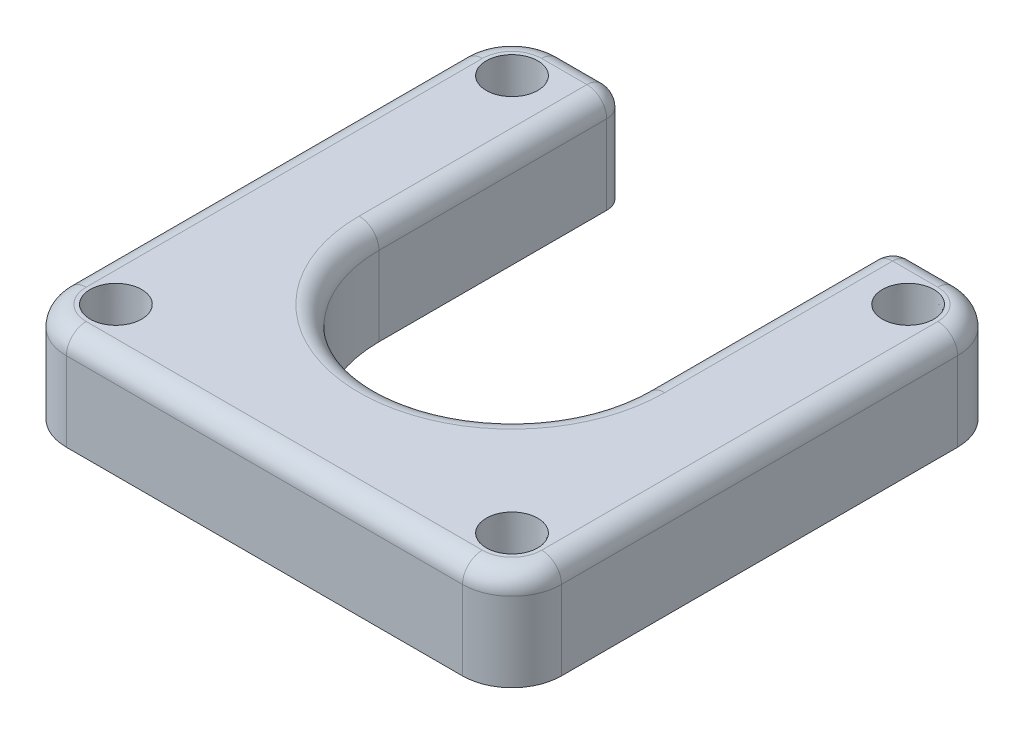
ISO-10303-21;
HEADER;
FILE_DESCRIPTION(('STEP AP214'),'2;1');
FILE_NAME('part.step','',(''),(''),'','','');
FILE_SCHEMA(('AUTOMOTIVE_DESIGN { 1 0 10303 214 1 1 1 1 }'));
ENDSEC;
DATA;
#1=APPLICATION_CONTEXT('core data for automotive mechanical design processes');
#2=APPLICATION_PROTOCOL_DEFINITION('international standard','automotive_design',2000,#1);
#3=PRODUCT_CONTEXT('',#1,'mechanical');
#4=PRODUCT('Part','Part','',(#3));
#5=PRODUCT_RELATED_PRODUCT_CATEGORY('part','',(#4));
#6=PRODUCT_DEFINITION_FORMATION('','',#4);
#7=PRODUCT_DEFINITION_CONTEXT('part definition',#1,'design');
#8=PRODUCT_DEFINITION('design','',#6,#7);
#9=PRODUCT_DEFINITION_SHAPE('','',#8);
#10=(LENGTH_UNIT() NAMED_UNIT(*) SI_UNIT(.MILLI.,.METRE.));
#11=(NAMED_UNIT(*) PLANE_ANGLE_UNIT() SI_UNIT($,.RADIAN.));
#12=(NAMED_UNIT(*) SI_UNIT($,.STERADIAN.) SOLID_ANGLE_UNIT());
#13=UNCERTAINTY_MEASURE_WITH_UNIT(LENGTH_MEASURE(1.E-05),#10,'distance_accuracy_value','');
#14=(GEOMETRIC_REPRESENTATION_CONTEXT(3) GLOBAL_UNCERTAINTY_ASSIGNED_CONTEXT((#13)) GLOBAL_UNIT_ASSIGNED_CONTEXT((#10,
#11,#12)) REPRESENTATION_CONTEXT('',''));
#15=CARTESIAN_POINT('',(0.,0.,0.));
#16=DIRECTION('',(0.,0.,1.));
#17=DIRECTION('',(1.,0.,0.));
#18=AXIS2_PLACEMENT_3D('',#15,#16,#17);
#19=CARTESIAN_POINT('',(-20.,10.,-25.));
#20=DIRECTION('',(0.,0.,-1.));
#21=DIRECTION('',(-1.,0.,0.));
#22=AXIS2_PLACEMENT_3D('',#19,#20,#21);
#23=PLANE('',#22);
#24=DIRECTION('',(0.,-1.,0.));
#25=VECTOR('',#24,1.);
#26=CARTESIAN_POINT('',(15.435,10.,-25.));
#27=LINE('',#26,#25);
#28=CARTESIAN_POINT('',(15.435,0.,-25.));
#29=VERTEX_POINT('',#28);
#30=CARTESIAN_POINT('',(15.435,8.,-25.));
#31=VERTEX_POINT('',#30);
#32=EDGE_CURVE('E329',#29,#31,#27,.F.);
#33=ORIENTED_EDGE('',*,*,#32,.T.);
#34=DIRECTION('',(1.,0.,0.));
#35=VECTOR('',#34,1.);
#36=CARTESIAN_POINT('',(20.,8.,-25.));
#37=LINE('',#36,#35);
#38=CARTESIAN_POINT('',(20.,8.,-25.));
#39=VERTEX_POINT('',#38);
#40=EDGE_CURVE('E349',#31,#39,#37,.T.);
#41=ORIENTED_EDGE('',*,*,#40,.T.);
#42=DIRECTION('',(0.,-1.,0.));
#43=VECTOR('',#42,1.);
#44=CARTESIAN_POINT('',(20.,10.,-25.));
#45=LINE('',#44,#43);
#46=CARTESIAN_POINT('',(20.,0.,-25.));
#47=VERTEX_POINT('',#46);
#48=EDGE_CURVE('E269',#39,#47,#45,.T.);
#49=ORIENTED_EDGE('',*,*,#48,.T.);
#50=DIRECTION('',(1.,0.,0.));
#51=VECTOR('',#50,1.);
#52=CARTESIAN_POINT('',(-20.,0.,-25.));
#53=LINE('',#52,#51);
#54=EDGE_CURVE('E235',#29,#47,#53,.T.);
#55=ORIENTED_EDGE('',*,*,#54,.F.);
#56=EDGE_LOOP('',(#33,#41,#49,#55));
#57=FACE_BOUND('',#56,.T.);
#58=ADVANCED_FACE('F41',(#57),#23,.T.);
#59=CARTESIAN_POINT('',(-20.,10.,20.));
#60=DIRECTION('',(0.,-1.,0.));
#61=DIRECTION('',(0.,0.,-1.));
#62=AXIS2_PLACEMENT_3D('',#59,#60,#61);
#63=PLANE('',#62);
#64=CARTESIAN_POINT('',(20.,10.,-20.));
#65=DIRECTION('',(0.,-1.,0.));
#66=DIRECTION('',(0.,0.,-1.));
#67=AXIS2_PLACEMENT_3D('',#64,#65,#66);
#68=CIRCLE('',#67,2.6);
#69=CARTESIAN_POINT('',(20.,10.,-22.6));
#70=VERTEX_POINT('',#69);
#71=EDGE_CURVE('E919',#70,#70,#68,.T.);
#72=ORIENTED_EDGE('',*,*,#71,.T.);
#73=EDGE_LOOP('',(#72));
#74=FACE_BOUND('',#73,.T.);
#75=CARTESIAN_POINT('',(-20.,10.,20.));
#76=DIRECTION('',(0.,-1.,0.));
#77=DIRECTION('',(0.,0.,-1.));
#78=AXIS2_PLACEMENT_3D('',#75,#76,#77);
#79=CIRCLE('',#78,2.6);
#80=CARTESIAN_POINT('',(-20.,10.,17.4));
#81=VERTEX_POINT('',#80);
#82=EDGE_CURVE('E938',#81,#81,#79,.T.);
#83=ORIENTED_EDGE('',*,*,#82,.T.);
#84=EDGE_LOOP('',(#83));
#85=FACE_BOUND('',#84,.T.);
#86=CARTESIAN_POINT('',(20.,10.,20.));
#87=DIRECTION('',(0.,-1.,0.));
#88=DIRECTION('',(0.,0.,-1.));
#89=AXIS2_PLACEMENT_3D('',#86,#87,#88);
#90=CIRCLE('',#89,2.6);
#91=CARTESIAN_POINT('',(20.,10.,17.4));
#92=VERTEX_POINT('',#91);
#93=EDGE_CURVE('E947',#92,#92,#90,.T.);
#94=ORIENTED_EDGE('',*,*,#93,.T.);
#95=EDGE_LOOP('',(#94));
#96=FACE_BOUND('',#95,.T.);
#97=CARTESIAN_POINT('',(-20.,10.,-20.));
#98=DIRECTION('',(0.,-1.,0.));
#99=DIRECTION('',(0.,0.,-1.));
#100=AXIS2_PLACEMENT_3D('',#97,#98,#99);
#101=CIRCLE('',#100,2.6);
#102=CARTESIAN_POINT('',(-20.,10.,-22.6));
#103=VERTEX_POINT('',#102);
#104=EDGE_CURVE('E915',#103,#103,#101,.T.);
#105=ORIENTED_EDGE('',*,*,#104,.T.);
#106=EDGE_LOOP('',(#105));
#107=FACE_BOUND('',#106,.T.);
#108=CARTESIAN_POINT('',(20.,10.,-20.));
#109=DIRECTION('',(0.,-1.,0.));
#110=DIRECTION('',(0.,0.,-1.));
#111=AXIS2_PLACEMENT_3D('',#108,#109,#110);
#112=CIRCLE('',#111,3.);
#113=CARTESIAN_POINT('',(23.,10.,-20.));
#114=VERTEX_POINT('',#113);
#115=CARTESIAN_POINT('',(20.,10.,-23.));
#116=VERTEX_POINT('',#115);
#117=EDGE_CURVE('E373',#114,#116,#112,.F.);
#118=ORIENTED_EDGE('',*,*,#117,.T.);
#119=DIRECTION('',(1.,0.,0.));
#120=VECTOR('',#119,1.);
#121=CARTESIAN_POINT('',(15.435,10.,-23.));
#122=LINE('',#121,#120);
#123=CARTESIAN_POINT('',(15.435,10.,-23.));
#124=VERTEX_POINT('',#123);
#125=EDGE_CURVE('E376',#116,#124,#122,.F.);
#126=ORIENTED_EDGE('',*,*,#125,.T.);
#127=DIRECTION('',(0.,0.,-1.));
#128=VECTOR('',#127,1.);
#129=CARTESIAN_POINT('',(15.435,10.,0.));
#130=LINE('',#129,#128);
#131=CARTESIAN_POINT('',(15.435,10.,0.));
#132=VERTEX_POINT('',#131);
#133=EDGE_CURVE('E259',#124,#132,#130,.F.);
#134=ORIENTED_EDGE('',*,*,#133,.T.);
#135=CARTESIAN_POINT('',(0.,10.,0.));
#136=DIRECTION('',(0.,-1.,0.));
#137=DIRECTION('',(0.,0.,-1.));
#138=AXIS2_PLACEMENT_3D('',#135,#136,#137);
#139=CIRCLE('',#138,15.435);
#140=CARTESIAN_POINT('',(-15.435,10.,0.));
#141=VERTEX_POINT('',#140);
#142=EDGE_CURVE('E299',#132,#141,#139,.T.);
#143=ORIENTED_EDGE('',*,*,#142,.T.);
#144=DIRECTION('',(0.,0.,-1.));
#145=VECTOR('',#144,1.);
#146=CARTESIAN_POINT('',(-15.435,10.,20.));
#147=LINE('',#146,#145);
#148=CARTESIAN_POINT('',(-15.435,10.,-23.));
#149=VERTEX_POINT('',#148);
#150=EDGE_CURVE('E302',#141,#149,#147,.T.);
#151=ORIENTED_EDGE('',*,*,#150,.T.);
#152=DIRECTION('',(1.,0.,0.));
#153=VECTOR('',#152,1.);
#154=CARTESIAN_POINT('',(-20.,10.,-23.));
#155=LINE('',#154,#153);
#156=CARTESIAN_POINT('',(-20.,10.,-23.));
#157=VERTEX_POINT('',#156);
#158=EDGE_CURVE('E358',#149,#157,#155,.F.);
#159=ORIENTED_EDGE('',*,*,#158,.T.);
#160=CARTESIAN_POINT('',(-20.,10.,-20.));
#161=DIRECTION('',(0.,-1.,0.));
#162=DIRECTION('',(0.,0.,-1.));
#163=AXIS2_PLACEMENT_3D('',#160,#161,#162);
#164=CIRCLE('',#163,3.);
#165=CARTESIAN_POINT('',(-23.,10.,-20.));
#166=VERTEX_POINT('',#165);
#167=EDGE_CURVE('E355',#157,#166,#164,.F.);
#168=ORIENTED_EDGE('',*,*,#167,.T.);
#169=DIRECTION('',(0.,0.,-1.));
#170=VECTOR('',#169,1.);
#171=CARTESIAN_POINT('',(-23.,10.,20.));
#172=LINE('',#171,#170);
#173=CARTESIAN_POINT('',(-23.,10.,20.));
#174=VERTEX_POINT('',#173);
#175=EDGE_CURVE('E352',#166,#174,#172,.F.);
#176=ORIENTED_EDGE('',*,*,#175,.T.);
#177=CARTESIAN_POINT('',(-20.,10.,20.));
#178=DIRECTION('',(0.,-1.,0.));
#179=DIRECTION('',(0.,0.,-1.));
#180=AXIS2_PLACEMENT_3D('',#177,#178,#179);
#181=CIRCLE('',#180,3.);
#182=CARTESIAN_POINT('',(-20.,10.,23.));
#183=VERTEX_POINT('',#182);
#184=EDGE_CURVE('E361',#174,#183,#181,.F.);
#185=ORIENTED_EDGE('',*,*,#184,.T.);
#186=DIRECTION('',(1.,0.,0.));
#187=VECTOR('',#186,1.);
#188=CARTESIAN_POINT('',(-20.,10.,23.));
#189=LINE('',#188,#187);
#190=CARTESIAN_POINT('',(20.,10.,23.));
#191=VERTEX_POINT('',#190);
#192=EDGE_CURVE('E364',#183,#191,#189,.T.);
#193=ORIENTED_EDGE('',*,*,#192,.T.);
#194=CARTESIAN_POINT('',(20.,10.,20.));
#195=DIRECTION('',(0.,-1.,0.));
#196=DIRECTION('',(0.,0.,-1.));
#197=AXIS2_PLACEMENT_3D('',#194,#195,#196);
#198=CIRCLE('',#197,3.);
#199=CARTESIAN_POINT('',(23.,10.,20.));
#200=VERTEX_POINT('',#199);
#201=EDGE_CURVE('E367',#191,#200,#198,.F.);
#202=ORIENTED_EDGE('',*,*,#201,.T.);
#203=DIRECTION('',(0.,0.,-1.));
#204=VECTOR('',#203,1.);
#205=CARTESIAN_POINT('',(23.,10.,20.));
#206=LINE('',#205,#204);
#207=EDGE_CURVE('E370',#200,#114,#206,.T.);
#208=ORIENTED_EDGE('',*,*,#207,.T.);
#209=EDGE_LOOP('',(#118,#126,#134,#143,#151,#159,#168,#176,#185,#193,#202,#208));
#210=FACE_BOUND('',#209,.T.);
#211=ADVANCED_FACE('F539',(#74,#85,#96,#107,#210),#63,.F.);
#212=CARTESIAN_POINT('',(-20.,0.,20.));
#213=DIRECTION('',(0.,-1.,0.));
#214=DIRECTION('',(0.,0.,-1.));
#215=AXIS2_PLACEMENT_3D('',#212,#213,#214);
#216=PLANE('',#215);
#217=CARTESIAN_POINT('',(-20.,0.,-20.));
#218=DIRECTION('',(0.,1.,0.));
#219=DIRECTION('',(0.,0.,1.));
#220=AXIS2_PLACEMENT_3D('',#217,#218,#219);
#221=CIRCLE('',#220,1.7);
#222=CARTESIAN_POINT('',(-20.,0.,-18.3));
#223=VERTEX_POINT('',#222);
#224=EDGE_CURVE('E210',#223,#223,#221,.T.);
#225=ORIENTED_EDGE('',*,*,#224,.T.);
#226=EDGE_LOOP('',(#225));
#227=FACE_BOUND('',#226,.T.);
#228=CARTESIAN_POINT('',(-20.,0.,-25.));
#229=VERTEX_POINT('',#228);
#230=CARTESIAN_POINT('',(-15.435,0.,-25.));
#231=VERTEX_POINT('',#230);
#232=EDGE_CURVE('E236',#229,#231,#53,.T.);
#233=ORIENTED_EDGE('',*,*,#232,.T.);
#234=CARTESIAN_POINT('',(-15.435,0.,-23.));
#235=DIRECTION('',(0.,-1.,0.));
#236=DIRECTION('',(0.,0.,-1.));
#237=AXIS2_PLACEMENT_3D('',#234,#235,#236);
#238=CIRCLE('',#237,2.);
#239=CARTESIAN_POINT('',(-13.435,0.,-23.));
#240=VERTEX_POINT('',#239);
#241=EDGE_CURVE('E208',#231,#240,#238,.T.);
#242=ORIENTED_EDGE('',*,*,#241,.T.);
#243=DIRECTION('',(0.,0.,-1.));
#244=VECTOR('',#243,1.);
#245=CARTESIAN_POINT('',(-13.435,0.,0.));
#246=LINE('',#245,#244);
#247=CARTESIAN_POINT('',(-13.435,0.,0.));
#248=VERTEX_POINT('',#247);
#249=EDGE_CURVE('E184',#248,#240,#246,.T.);
#250=ORIENTED_EDGE('',*,*,#249,.F.);
#251=CARTESIAN_POINT('',(0.,0.,0.));
#252=DIRECTION('',(0.,1.,0.));
#253=DIRECTION('',(0.,0.,1.));
#254=AXIS2_PLACEMENT_3D('',#251,#252,#253);
#255=CIRCLE('',#254,13.435);
#256=CARTESIAN_POINT('',(13.435,0.,0.));
#257=VERTEX_POINT('',#256);
#258=EDGE_CURVE('E195',#248,#257,#255,.T.);
#259=ORIENTED_EDGE('',*,*,#258,.T.);
#260=DIRECTION('',(0.,0.,-1.));
#261=VECTOR('',#260,1.);
#262=CARTESIAN_POINT('',(13.435,0.,0.));
#263=LINE('',#262,#261);
#264=CARTESIAN_POINT('',(13.435,0.,-23.));
#265=VERTEX_POINT('',#264);
#266=EDGE_CURVE('E202',#257,#265,#263,.T.);
#267=ORIENTED_EDGE('',*,*,#266,.T.);
#268=CARTESIAN_POINT('',(15.435,0.,-23.));
#269=DIRECTION('',(0.,-1.,0.));
#270=DIRECTION('',(0.,0.,-1.));
#271=AXIS2_PLACEMENT_3D('',#268,#269,#270);
#272=CIRCLE('',#271,2.);
#273=EDGE_CURVE('E317',#265,#29,#272,.T.);
#274=ORIENTED_EDGE('',*,*,#273,.T.);
#275=ORIENTED_EDGE('',*,*,#54,.T.);
#276=CARTESIAN_POINT('',(20.,0.,-20.));
#277=DIRECTION('',(0.,-1.,0.));
#278=DIRECTION('',(0.,0.,-1.));
#279=AXIS2_PLACEMENT_3D('',#276,#277,#278);
#280=CIRCLE('',#279,5.);
#281=CARTESIAN_POINT('',(25.,0.,-20.));
#282=VERTEX_POINT('',#281);
#283=EDGE_CURVE('E239',#47,#282,#280,.T.);
#284=ORIENTED_EDGE('',*,*,#283,.T.);
#285=DIRECTION('',(0.,0.,-1.));
#286=VECTOR('',#285,1.);
#287=CARTESIAN_POINT('',(25.,0.,20.));
#288=LINE('',#287,#286);
#289=CARTESIAN_POINT('',(25.,0.,20.));
#290=VERTEX_POINT('',#289);
#291=EDGE_CURVE('E243',#290,#282,#288,.T.);
#292=ORIENTED_EDGE('',*,*,#291,.F.);
#293=CARTESIAN_POINT('',(20.,0.,20.));
#294=DIRECTION('',(0.,-1.,0.));
#295=DIRECTION('',(0.,0.,-1.));
#296=AXIS2_PLACEMENT_3D('',#293,#294,#295);
#297=CIRCLE('',#296,5.);
#298=CARTESIAN_POINT('',(20.,0.,25.));
#299=VERTEX_POINT('',#298);
#300=EDGE_CURVE('E247',#290,#299,#297,.T.);
#301=ORIENTED_EDGE('',*,*,#300,.T.);
#302=DIRECTION('',(1.,0.,0.));
#303=VECTOR('',#302,1.);
#304=CARTESIAN_POINT('',(-20.,0.,25.));
#305=LINE('',#304,#303);
#306=CARTESIAN_POINT('',(-20.,0.,25.));
#307=VERTEX_POINT('',#306);
#308=EDGE_CURVE('E251',#307,#299,#305,.T.);
#309=ORIENTED_EDGE('',*,*,#308,.F.);
#310=CARTESIAN_POINT('',(-20.,0.,20.));
#311=DIRECTION('',(0.,-1.,0.));
#312=DIRECTION('',(0.,0.,-1.));
#313=AXIS2_PLACEMENT_3D('',#310,#311,#312);
#314=CIRCLE('',#313,5.);
#315=CARTESIAN_POINT('',(-25.,0.,20.));
#316=VERTEX_POINT('',#315);
#317=EDGE_CURVE('E191',#307,#316,#314,.T.);
#318=ORIENTED_EDGE('',*,*,#317,.T.);
#319=DIRECTION('',(0.,0.,-1.));
#320=VECTOR('',#319,1.);
#321=CARTESIAN_POINT('',(-25.,0.,20.));
#322=LINE('',#321,#320);
#323=CARTESIAN_POINT('',(-25.,0.,-20.));
#324=VERTEX_POINT('',#323);
#325=EDGE_CURVE('E227',#316,#324,#322,.T.);
#326=ORIENTED_EDGE('',*,*,#325,.T.);
#327=CARTESIAN_POINT('',(-20.,0.,-20.));
#328=DIRECTION('',(0.,-1.,0.));
#329=DIRECTION('',(0.,0.,-1.));
#330=AXIS2_PLACEMENT_3D('',#327,#328,#329);
#331=CIRCLE('',#330,5.);
#332=EDGE_CURVE('E231',#324,#229,#331,.T.);
#333=ORIENTED_EDGE('',*,*,#332,.T.);
#334=EDGE_LOOP('',(#233,#242,#250,#259,#267,#274,#275,#284,#292,#301,#309,#318,#326,#333));
#335=FACE_BOUND('',#334,.T.);
#336=CARTESIAN_POINT('',(-20.,0.,20.));
#337=DIRECTION('',(0.,-1.,0.));
#338=DIRECTION('',(0.,0.,-1.));
#339=AXIS2_PLACEMENT_3D('',#336,#337,#338);
#340=CIRCLE('',#339,1.7);
#341=CARTESIAN_POINT('',(-20.,0.,18.3));
#342=VERTEX_POINT('',#341);
#343=EDGE_CURVE('E214',#342,#342,#340,.T.);
#344=ORIENTED_EDGE('',*,*,#343,.F.);
#345=EDGE_LOOP('',(#344));
#346=FACE_BOUND('',#345,.T.);
#347=CARTESIAN_POINT('',(20.,0.,20.));
#348=DIRECTION('',(0.,-1.,0.));
#349=DIRECTION('',(0.,0.,-1.));
#350=AXIS2_PLACEMENT_3D('',#347,#348,#349);
#351=CIRCLE('',#350,1.7);
#352=CARTESIAN_POINT('',(20.,0.,18.3));
#353=VERTEX_POINT('',#352);
#354=EDGE_CURVE('E925',#353,#353,#351,.T.);
#355=ORIENTED_EDGE('',*,*,#354,.F.);
#356=EDGE_LOOP('',(#355));
#357=FACE_BOUND('',#356,.T.);
#358=CARTESIAN_POINT('',(20.,0.,-20.));
#359=DIRECTION('',(0.,1.,0.));
#360=DIRECTION('',(0.,0.,1.));
#361=AXIS2_PLACEMENT_3D('',#358,#359,#360);
#362=CIRCLE('',#361,1.7);
#363=CARTESIAN_POINT('',(20.,0.,-18.3));
#364=VERTEX_POINT('',#363);
#365=EDGE_CURVE('E217',#364,#364,#362,.T.);
#366=ORIENTED_EDGE('',*,*,#365,.T.);
#367=EDGE_LOOP('',(#366));
#368=FACE_BOUND('',#367,.T.);
#369=ADVANCED_FACE('F205',(#227,#335,#346,#357,#368),#216,.T.);
#370=CARTESIAN_POINT('',(-20.,10.,20.));
#371=DIRECTION('',(0.,-1.,0.));
#372=DIRECTION('',(0.,0.,-1.));
#373=AXIS2_PLACEMENT_3D('',#370,#371,#372);
#374=CYLINDRICAL_SURFACE('',#373,5.);
#375=DIRECTION('',(0.,-1.,0.));
#376=VECTOR('',#375,1.);
#377=CARTESIAN_POINT('',(-20.,10.,25.));
#378=LINE('',#377,#376);
#379=CARTESIAN_POINT('',(-20.,8.,25.));
#380=VERTEX_POINT('',#379);
#381=EDGE_CURVE('E256',#380,#307,#378,.T.);
#382=ORIENTED_EDGE('',*,*,#381,.F.);
#383=CARTESIAN_POINT('',(-20.,8.,20.));
#384=DIRECTION('',(0.,-1.,0.));
#385=DIRECTION('',(0.,0.,-1.));
#386=AXIS2_PLACEMENT_3D('',#383,#384,#385);
#387=CIRCLE('',#386,5.);
#388=CARTESIAN_POINT('',(-25.,8.,20.));
#389=VERTEX_POINT('',#388);
#390=EDGE_CURVE('E391',#380,#389,#387,.T.);
#391=ORIENTED_EDGE('',*,*,#390,.T.);
#392=DIRECTION('',(0.,-1.,0.));
#393=VECTOR('',#392,1.);
#394=CARTESIAN_POINT('',(-25.,10.,20.));
#395=LINE('',#394,#393);
#396=EDGE_CURVE('E255',#389,#316,#395,.T.);
#397=ORIENTED_EDGE('',*,*,#396,.T.);
#398=ORIENTED_EDGE('',*,*,#317,.F.);
#399=EDGE_LOOP('',(#382,#391,#397,#398));
#400=FACE_BOUND('',#399,.T.);
#401=ADVANCED_FACE('F529',(#400),#374,.T.);
#402=CARTESIAN_POINT('',(-20.,10.,25.));
#403=DIRECTION('',(0.,0.,-1.));
#404=DIRECTION('',(-1.,0.,0.));
#405=AXIS2_PLACEMENT_3D('',#402,#403,#404);
#406=PLANE('',#405);
#407=DIRECTION('',(0.,-1.,0.));
#408=VECTOR('',#407,1.);
#409=CARTESIAN_POINT('',(20.,10.,25.));
#410=LINE('',#409,#408);
#411=CARTESIAN_POINT('',(20.,8.,25.));
#412=VERTEX_POINT('',#411);
#413=EDGE_CURVE('E260',#412,#299,#410,.T.);
#414=ORIENTED_EDGE('',*,*,#413,.F.);
#415=DIRECTION('',(1.,0.,0.));
#416=VECTOR('',#415,1.);
#417=CARTESIAN_POINT('',(-20.,8.,25.));
#418=LINE('',#417,#416);
#419=EDGE_CURVE('E388',#412,#380,#418,.F.);
#420=ORIENTED_EDGE('',*,*,#419,.T.);
#421=ORIENTED_EDGE('',*,*,#381,.T.);
#422=ORIENTED_EDGE('',*,*,#308,.T.);
#423=EDGE_LOOP('',(#414,#420,#421,#422));
#424=FACE_BOUND('',#423,.T.);
#425=ADVANCED_FACE('F516',(#424),#406,.F.);
#426=CARTESIAN_POINT('',(20.,10.,20.));
#427=DIRECTION('',(0.,-1.,0.));
#428=DIRECTION('',(0.,0.,-1.));
#429=AXIS2_PLACEMENT_3D('',#426,#427,#428);
#430=CYLINDRICAL_SURFACE('',#429,5.);
#431=DIRECTION('',(0.,-1.,0.));
#432=VECTOR('',#431,1.);
#433=CARTESIAN_POINT('',(25.,10.,20.));
#434=LINE('',#433,#432);
#435=CARTESIAN_POINT('',(25.,8.,20.));
#436=VERTEX_POINT('',#435);
#437=EDGE_CURVE('E263',#436,#290,#434,.T.);
#438=ORIENTED_EDGE('',*,*,#437,.F.);
#439=CARTESIAN_POINT('',(20.,8.,20.));
#440=DIRECTION('',(0.,-1.,0.));
#441=DIRECTION('',(0.,0.,-1.));
#442=AXIS2_PLACEMENT_3D('',#439,#440,#441);
#443=CIRCLE('',#442,5.);
#444=EDGE_CURVE('E385',#436,#412,#443,.T.);
#445=ORIENTED_EDGE('',*,*,#444,.T.);
#446=ORIENTED_EDGE('',*,*,#413,.T.);
#447=ORIENTED_EDGE('',*,*,#300,.F.);
#448=EDGE_LOOP('',(#438,#445,#446,#447));
#449=FACE_BOUND('',#448,.T.);
#450=ADVANCED_FACE('F512',(#449),#430,.T.);
#451=CARTESIAN_POINT('',(25.,10.,20.));
#452=DIRECTION('',(-1.,0.,0.));
#453=DIRECTION('',(0.,0.,1.));
#454=AXIS2_PLACEMENT_3D('',#451,#452,#453);
#455=PLANE('',#454);
#456=DIRECTION('',(0.,-1.,0.));
#457=VECTOR('',#456,1.);
#458=CARTESIAN_POINT('',(25.,10.,-20.));
#459=LINE('',#458,#457);
#460=CARTESIAN_POINT('',(25.,8.,-20.));
#461=VERTEX_POINT('',#460);
#462=EDGE_CURVE('E266',#461,#282,#459,.T.);
#463=ORIENTED_EDGE('',*,*,#462,.F.);
#464=DIRECTION('',(0.,0.,-1.));
#465=VECTOR('',#464,1.);
#466=CARTESIAN_POINT('',(25.,8.,20.));
#467=LINE('',#466,#465);
#468=EDGE_CURVE('E382',#461,#436,#467,.F.);
#469=ORIENTED_EDGE('',*,*,#468,.T.);
#470=ORIENTED_EDGE('',*,*,#437,.T.);
#471=ORIENTED_EDGE('',*,*,#291,.T.);
#472=EDGE_LOOP('',(#463,#469,#470,#471));
#473=FACE_BOUND('',#472,.T.);
#474=ADVANCED_FACE('F498',(#473),#455,.F.);
#475=CARTESIAN_POINT('',(20.,10.,-20.));
#476=DIRECTION('',(0.,-1.,0.));
#477=DIRECTION('',(0.,0.,-1.));
#478=AXIS2_PLACEMENT_3D('',#475,#476,#477);
#479=CYLINDRICAL_SURFACE('',#478,5.);
#480=ORIENTED_EDGE('',*,*,#48,.F.);
#481=CARTESIAN_POINT('',(20.,8.,-20.));
#482=DIRECTION('',(0.,-1.,0.));
#483=DIRECTION('',(0.,0.,-1.));
#484=AXIS2_PLACEMENT_3D('',#481,#482,#483);
#485=CIRCLE('',#484,5.);
#486=EDGE_CURVE('E379',#39,#461,#485,.T.);
#487=ORIENTED_EDGE('',*,*,#486,.T.);
#488=ORIENTED_EDGE('',*,*,#462,.T.);
#489=ORIENTED_EDGE('',*,*,#283,.F.);
#490=EDGE_LOOP('',(#480,#487,#488,#489));
#491=FACE_BOUND('',#490,.T.);
#492=ADVANCED_FACE('F494',(#491),#479,.T.);
#493=DIRECTION('',(0.,-1.,0.));
#494=VECTOR('',#493,1.);
#495=CARTESIAN_POINT('',(-20.,10.,-25.));
#496=LINE('',#495,#494);
#497=CARTESIAN_POINT('',(-20.,8.,-25.));
#498=VERTEX_POINT('',#497);
#499=EDGE_CURVE('E272',#498,#229,#496,.T.);
#500=ORIENTED_EDGE('',*,*,#499,.F.);
#501=DIRECTION('',(1.,0.,0.));
#502=VECTOR('',#501,1.);
#503=CARTESIAN_POINT('',(-15.435,8.,-25.));
#504=LINE('',#503,#502);
#505=CARTESIAN_POINT('',(-15.435,8.,-25.));
#506=VERTEX_POINT('',#505);
#507=EDGE_CURVE('E400',#498,#506,#504,.T.);
#508=ORIENTED_EDGE('',*,*,#507,.T.);
#509=DIRECTION('',(0.,-1.,0.));
#510=VECTOR('',#509,1.);
#511=CARTESIAN_POINT('',(-15.435,0.,-25.));
#512=LINE('',#511,#510);
#513=EDGE_CURVE('E314',#506,#231,#512,.T.);
#514=ORIENTED_EDGE('',*,*,#513,.T.);
#515=ORIENTED_EDGE('',*,*,#232,.F.);
#516=EDGE_LOOP('',(#500,#508,#514,#515));
#517=FACE_BOUND('',#516,.T.);
#518=ADVANCED_FACE('F550',(#517),#23,.T.);
#519=CARTESIAN_POINT('',(-20.,10.,-20.));
#520=DIRECTION('',(0.,-1.,0.));
#521=DIRECTION('',(0.,0.,-1.));
#522=AXIS2_PLACEMENT_3D('',#519,#520,#521);
#523=CYLINDRICAL_SURFACE('',#522,5.);
#524=DIRECTION('',(0.,-1.,0.));
#525=VECTOR('',#524,1.);
#526=CARTESIAN_POINT('',(-25.,10.,-20.));
#527=LINE('',#526,#525);
#528=CARTESIAN_POINT('',(-25.,8.,-20.));
#529=VERTEX_POINT('',#528);
#530=EDGE_CURVE('E275',#529,#324,#527,.T.);
#531=ORIENTED_EDGE('',*,*,#530,.F.);
#532=CARTESIAN_POINT('',(-20.,8.,-20.));
#533=DIRECTION('',(0.,-1.,0.));
#534=DIRECTION('',(0.,0.,-1.));
#535=AXIS2_PLACEMENT_3D('',#532,#533,#534);
#536=CIRCLE('',#535,5.);
#537=EDGE_CURVE('E51',#529,#498,#536,.T.);
#538=ORIENTED_EDGE('',*,*,#537,.T.);
#539=ORIENTED_EDGE('',*,*,#499,.T.);
#540=ORIENTED_EDGE('',*,*,#332,.F.);
#541=EDGE_LOOP('',(#531,#538,#539,#540));
#542=FACE_BOUND('',#541,.T.);
#543=ADVANCED_FACE('F565',(#542),#523,.T.);
#544=CARTESIAN_POINT('',(-25.,10.,20.));
#545=DIRECTION('',(-1.,0.,0.));
#546=DIRECTION('',(0.,0.,1.));
#547=AXIS2_PLACEMENT_3D('',#544,#545,#546);
#548=PLANE('',#547);
#549=ORIENTED_EDGE('',*,*,#396,.F.);
#550=DIRECTION('',(0.,0.,-1.));
#551=VECTOR('',#550,1.);
#552=CARTESIAN_POINT('',(-25.,8.,-20.));
#553=LINE('',#552,#551);
#554=EDGE_CURVE('E11',#389,#529,#553,.T.);
#555=ORIENTED_EDGE('',*,*,#554,.T.);
#556=ORIENTED_EDGE('',*,*,#530,.T.);
#557=ORIENTED_EDGE('',*,*,#325,.F.);
#558=EDGE_LOOP('',(#549,#555,#556,#557));
#559=FACE_BOUND('',#558,.T.);
#560=ADVANCED_FACE('F532',(#559),#548,.T.);
#561=CARTESIAN_POINT('',(-13.435,10.,0.));
#562=DIRECTION('',(-1.,0.,0.));
#563=DIRECTION('',(0.,0.,1.));
#564=AXIS2_PLACEMENT_3D('',#561,#562,#563);
#565=PLANE('',#564);
#566=DIRECTION('',(0.,-1.,0.));
#567=VECTOR('',#566,1.);
#568=CARTESIAN_POINT('',(-13.435,10.,-23.));
#569=LINE('',#568,#567);
#570=CARTESIAN_POINT('',(-13.435,8.,-23.));
#571=VERTEX_POINT('',#570);
#572=EDGE_CURVE('E306',#240,#571,#569,.F.);
#573=ORIENTED_EDGE('',*,*,#572,.T.);
#574=DIRECTION('',(0.,0.,-1.));
#575=VECTOR('',#574,1.);
#576=CARTESIAN_POINT('',(-13.435,8.,0.));
#577=LINE('',#576,#575);
#578=CARTESIAN_POINT('',(-13.435,8.,0.));
#579=VERTEX_POINT('',#578);
#580=EDGE_CURVE('E187',#571,#579,#577,.F.);
#581=ORIENTED_EDGE('',*,*,#580,.T.);
#582=DIRECTION('',(0.,-1.,0.));
#583=VECTOR('',#582,1.);
#584=CARTESIAN_POINT('',(-13.435,10.,0.));
#585=LINE('',#584,#583);
#586=EDGE_CURVE('E179',#579,#248,#585,.T.);
#587=ORIENTED_EDGE('',*,*,#586,.T.);
#588=ORIENTED_EDGE('',*,*,#249,.T.);
#589=EDGE_LOOP('',(#573,#581,#587,#588));
#590=FACE_BOUND('',#589,.T.);
#591=ADVANCED_FACE('F182',(#590),#565,.F.);
#592=CARTESIAN_POINT('',(0.,10.,0.));
#593=DIRECTION('',(0.,-1.,0.));
#594=DIRECTION('',(0.,0.,-1.));
#595=AXIS2_PLACEMENT_3D('',#592,#593,#594);
#596=CYLINDRICAL_SURFACE('',#595,13.435);
#597=ORIENTED_EDGE('',*,*,#586,.F.);
#598=CARTESIAN_POINT('',(0.,8.,0.));
#599=DIRECTION('',(0.,-1.,0.));
#600=DIRECTION('',(0.,0.,-1.));
#601=AXIS2_PLACEMENT_3D('',#598,#599,#600);
#602=CIRCLE('',#601,13.435);
#603=CARTESIAN_POINT('',(13.435,8.,0.));
#604=VERTEX_POINT('',#603);
#605=EDGE_CURVE('E311',#579,#604,#602,.F.);
#606=ORIENTED_EDGE('',*,*,#605,.T.);
#607=DIRECTION('',(0.,-1.,0.));
#608=VECTOR('',#607,1.);
#609=CARTESIAN_POINT('',(13.435,10.,0.));
#610=LINE('',#609,#608);
#611=EDGE_CURVE('E192',#604,#257,#610,.T.);
#612=ORIENTED_EDGE('',*,*,#611,.T.);
#613=ORIENTED_EDGE('',*,*,#258,.F.);
#614=EDGE_LOOP('',(#597,#606,#612,#613));
#615=FACE_BOUND('',#614,.T.);
#616=ADVANCED_FACE('F196',(#615),#596,.F.);
#617=CARTESIAN_POINT('',(13.435,10.,0.));
#618=DIRECTION('',(-1.,0.,0.));
#619=DIRECTION('',(0.,0.,1.));
#620=AXIS2_PLACEMENT_3D('',#617,#618,#619);
#621=PLANE('',#620);
#622=DIRECTION('',(0.,0.,-1.));
#623=VECTOR('',#622,1.);
#624=CARTESIAN_POINT('',(13.435,8.,-25.));
#625=LINE('',#624,#623);
#626=CARTESIAN_POINT('',(13.435,8.,-23.));
#627=VERTEX_POINT('',#626);
#628=EDGE_CURVE('E322',#604,#627,#625,.T.);
#629=ORIENTED_EDGE('',*,*,#628,.T.);
#630=DIRECTION('',(0.,-1.,0.));
#631=VECTOR('',#630,1.);
#632=CARTESIAN_POINT('',(13.435,10.,-23.));
#633=LINE('',#632,#631);
#634=EDGE_CURVE('E326',#627,#265,#633,.T.);
#635=ORIENTED_EDGE('',*,*,#634,.T.);
#636=ORIENTED_EDGE('',*,*,#266,.F.);
#637=ORIENTED_EDGE('',*,*,#611,.F.);
#638=EDGE_LOOP('',(#629,#635,#636,#637));
#639=FACE_BOUND('',#638,.T.);
#640=ADVANCED_FACE('F465',(#639),#621,.T.);
#641=CARTESIAN_POINT('',(-20.,10.,-20.));
#642=DIRECTION('',(0.,-1.,0.));
#643=DIRECTION('',(0.,0.,-1.));
#644=AXIS2_PLACEMENT_3D('',#641,#642,#643);
#645=CYLINDRICAL_SURFACE('',#644,1.7);
#646=CARTESIAN_POINT('',(-20.,6.1,-20.));
#647=DIRECTION('',(0.,-1.,0.));
#648=DIRECTION('',(0.,0.,-1.));
#649=AXIS2_PLACEMENT_3D('',#646,#647,#648);
#650=CIRCLE('',#649,1.7);
#651=CARTESIAN_POINT('',(-20.,6.1,-21.7));
#652=VERTEX_POINT('',#651);
#653=EDGE_CURVE('E293',#652,#652,#650,.T.);
#654=ORIENTED_EDGE('',*,*,#653,.F.);
#655=EDGE_LOOP('',(#654));
#656=FACE_BOUND('',#655,.T.);
#657=ORIENTED_EDGE('',*,*,#224,.F.);
#658=EDGE_LOOP('',(#657));
#659=FACE_BOUND('',#658,.T.);
#660=ADVANCED_FACE('F717',(#656,#659),#645,.F.);
#661=CARTESIAN_POINT('',(-20.,10.,20.));
#662=DIRECTION('',(0.,-1.,0.));
#663=DIRECTION('',(0.,0.,-1.));
#664=AXIS2_PLACEMENT_3D('',#661,#662,#663);
#665=CYLINDRICAL_SURFACE('',#664,1.7);
#666=CARTESIAN_POINT('',(-20.,6.1,20.));
#667=DIRECTION('',(0.,-1.,0.));
#668=DIRECTION('',(0.,0.,-1.));
#669=AXIS2_PLACEMENT_3D('',#666,#667,#668);
#670=CIRCLE('',#669,1.7);
#671=CARTESIAN_POINT('',(-20.,6.1,18.3));
#672=VERTEX_POINT('',#671);
#673=EDGE_CURVE('E289',#672,#672,#670,.F.);
#674=ORIENTED_EDGE('',*,*,#673,.T.);
#675=EDGE_LOOP('',(#674));
#676=FACE_BOUND('',#675,.T.);
#677=ORIENTED_EDGE('',*,*,#343,.T.);
#678=EDGE_LOOP('',(#677));
#679=FACE_BOUND('',#678,.T.);
#680=ADVANCED_FACE('F709',(#676,#679),#665,.F.);
#681=CARTESIAN_POINT('',(20.,10.,20.));
#682=DIRECTION('',(0.,-1.,0.));
#683=DIRECTION('',(0.,0.,-1.));
#684=AXIS2_PLACEMENT_3D('',#681,#682,#683);
#685=CYLINDRICAL_SURFACE('',#684,1.7);
#686=CARTESIAN_POINT('',(20.,6.1,20.));
#687=DIRECTION('',(0.,-1.,0.));
#688=DIRECTION('',(0.,0.,-1.));
#689=AXIS2_PLACEMENT_3D('',#686,#687,#688);
#690=CIRCLE('',#689,1.7);
#691=CARTESIAN_POINT('',(20.,6.1,18.3));
#692=VERTEX_POINT('',#691);
#693=EDGE_CURVE('E284',#692,#692,#690,.F.);
#694=ORIENTED_EDGE('',*,*,#693,.T.);
#695=EDGE_LOOP('',(#694));
#696=FACE_BOUND('',#695,.T.);
#697=ORIENTED_EDGE('',*,*,#354,.T.);
#698=EDGE_LOOP('',(#697));
#699=FACE_BOUND('',#698,.T.);
#700=ADVANCED_FACE('F701',(#696,#699),#685,.F.);
#701=CARTESIAN_POINT('',(20.,10.,-20.));
#702=DIRECTION('',(0.,-1.,0.));
#703=DIRECTION('',(0.,0.,-1.));
#704=AXIS2_PLACEMENT_3D('',#701,#702,#703);
#705=CYLINDRICAL_SURFACE('',#704,1.7);
#706=CARTESIAN_POINT('',(20.,6.1,-20.));
#707=DIRECTION('',(0.,-1.,0.));
#708=DIRECTION('',(0.,0.,-1.));
#709=AXIS2_PLACEMENT_3D('',#706,#707,#708);
#710=CIRCLE('',#709,1.7);
#711=CARTESIAN_POINT('',(20.,6.1,-21.7));
#712=VERTEX_POINT('',#711);
#713=EDGE_CURVE('E280',#712,#712,#710,.T.);
#714=ORIENTED_EDGE('',*,*,#713,.F.);
#715=EDGE_LOOP('',(#714));
#716=FACE_BOUND('',#715,.T.);
#717=ORIENTED_EDGE('',*,*,#365,.F.);
#718=EDGE_LOOP('',(#717));
#719=FACE_BOUND('',#718,.T.);
#720=ADVANCED_FACE('F693',(#716,#719),#705,.F.);
#721=CARTESIAN_POINT('',(20.,10.,-20.));
#722=DIRECTION('',(0.,1.,0.));
#723=DIRECTION('',(0.,0.,-1.));
#724=AXIS2_PLACEMENT_3D('',#721,#722,#723);
#725=CONICAL_SURFACE('',#724,2.6,0.026179938779915);
#726=CARTESIAN_POINT('',(20.,6.1,-20.));
#727=DIRECTION('',(0.,-1.,0.));
#728=DIRECTION('',(0.,0.,-1.));
#729=AXIS2_PLACEMENT_3D('',#726,#727,#728);
#730=CIRCLE('',#729,2.49787490588017);
#731=CARTESIAN_POINT('',(20.,6.1,-22.4978749058802));
#732=VERTEX_POINT('',#731);
#733=EDGE_CURVE('E942',#732,#732,#730,.T.);
#734=ORIENTED_EDGE('',*,*,#733,.T.);
#735=EDGE_LOOP('',(#734));
#736=FACE_BOUND('',#735,.T.);
#737=ORIENTED_EDGE('',*,*,#71,.F.);
#738=EDGE_LOOP('',(#737));
#739=FACE_BOUND('',#738,.T.);
#740=ADVANCED_FACE('F685',(#736,#739),#725,.F.);
#741=CARTESIAN_POINT('',(20.,6.1,-20.));
#742=DIRECTION('',(0.,-1.,0.));
#743=DIRECTION('',(0.,0.,-1.));
#744=AXIS2_PLACEMENT_3D('',#741,#742,#743);
#745=PLANE('',#744);
#746=ORIENTED_EDGE('',*,*,#713,.T.);
#747=EDGE_LOOP('',(#746));
#748=FACE_BOUND('',#747,.T.);
#749=ORIENTED_EDGE('',*,*,#733,.F.);
#750=EDGE_LOOP('',(#749));
#751=FACE_BOUND('',#750,.T.);
#752=ADVANCED_FACE('F677',(#748,#751),#745,.F.);
#753=CARTESIAN_POINT('',(20.,6.1,20.));
#754=DIRECTION('',(0.,-1.,0.));
#755=DIRECTION('',(0.,0.,-1.));
#756=AXIS2_PLACEMENT_3D('',#753,#754,#755);
#757=PLANE('',#756);
#758=CARTESIAN_POINT('',(20.,6.1,20.));
#759=DIRECTION('',(0.,-1.,0.));
#760=DIRECTION('',(0.,0.,-1.));
#761=AXIS2_PLACEMENT_3D('',#758,#759,#760);
#762=CIRCLE('',#761,2.49787490588017);
#763=CARTESIAN_POINT('',(20.,6.1,17.5021250941198));
#764=VERTEX_POINT('',#763);
#765=EDGE_CURVE('E342',#764,#764,#762,.T.);
#766=ORIENTED_EDGE('',*,*,#765,.F.);
#767=EDGE_LOOP('',(#766));
#768=FACE_BOUND('',#767,.T.);
#769=ORIENTED_EDGE('',*,*,#693,.F.);
#770=EDGE_LOOP('',(#769));
#771=FACE_BOUND('',#770,.T.);
#772=ADVANCED_FACE('F669',(#768,#771),#757,.F.);
#773=CARTESIAN_POINT('',(20.,10.,20.));
#774=DIRECTION('',(0.,1.,0.));
#775=DIRECTION('',(0.,0.,-1.));
#776=AXIS2_PLACEMENT_3D('',#773,#774,#775);
#777=CONICAL_SURFACE('',#776,2.6,0.026179938779915);
#778=ORIENTED_EDGE('',*,*,#765,.T.);
#779=EDGE_LOOP('',(#778));
#780=FACE_BOUND('',#779,.T.);
#781=ORIENTED_EDGE('',*,*,#93,.F.);
#782=EDGE_LOOP('',(#781));
#783=FACE_BOUND('',#782,.T.);
#784=ADVANCED_FACE('F661',(#780,#783),#777,.F.);
#785=CARTESIAN_POINT('',(-20.,6.1,20.));
#786=DIRECTION('',(0.,-1.,0.));
#787=DIRECTION('',(0.,0.,-1.));
#788=AXIS2_PLACEMENT_3D('',#785,#786,#787);
#789=PLANE('',#788);
#790=CARTESIAN_POINT('',(-20.,6.1,20.));
#791=DIRECTION('',(0.,-1.,0.));
#792=DIRECTION('',(0.,0.,-1.));
#793=AXIS2_PLACEMENT_3D('',#790,#791,#792);
#794=CIRCLE('',#793,2.49787490588017);
#795=CARTESIAN_POINT('',(-20.,6.1,17.5021250941198));
#796=VERTEX_POINT('',#795);
#797=EDGE_CURVE('E943',#796,#796,#794,.T.);
#798=ORIENTED_EDGE('',*,*,#797,.F.);
#799=EDGE_LOOP('',(#798));
#800=FACE_BOUND('',#799,.T.);
#801=ORIENTED_EDGE('',*,*,#673,.F.);
#802=EDGE_LOOP('',(#801));
#803=FACE_BOUND('',#802,.T.);
#804=ADVANCED_FACE('F653',(#800,#803),#789,.F.);
#805=CARTESIAN_POINT('',(-20.,10.,20.));
#806=DIRECTION('',(0.,1.,0.));
#807=DIRECTION('',(0.,0.,-1.));
#808=AXIS2_PLACEMENT_3D('',#805,#806,#807);
#809=CONICAL_SURFACE('',#808,2.6,0.026179938779915);
#810=ORIENTED_EDGE('',*,*,#797,.T.);
#811=EDGE_LOOP('',(#810));
#812=FACE_BOUND('',#811,.T.);
#813=ORIENTED_EDGE('',*,*,#82,.F.);
#814=EDGE_LOOP('',(#813));
#815=FACE_BOUND('',#814,.T.);
#816=ADVANCED_FACE('F645',(#812,#815),#809,.F.);
#817=CARTESIAN_POINT('',(-20.,10.,-20.));
#818=DIRECTION('',(0.,1.,0.));
#819=DIRECTION('',(0.,0.,-1.));
#820=AXIS2_PLACEMENT_3D('',#817,#818,#819);
#821=CONICAL_SURFACE('',#820,2.6,0.026179938779915);
#822=CARTESIAN_POINT('',(-20.,6.1,-20.));
#823=DIRECTION('',(0.,-1.,0.));
#824=DIRECTION('',(0.,0.,-1.));
#825=AXIS2_PLACEMENT_3D('',#822,#823,#824);
#826=CIRCLE('',#825,2.49787490588017);
#827=CARTESIAN_POINT('',(-20.,6.1,-22.4978749058802));
#828=VERTEX_POINT('',#827);
#829=EDGE_CURVE('E285',#828,#828,#826,.T.);
#830=ORIENTED_EDGE('',*,*,#829,.T.);
#831=EDGE_LOOP('',(#830));
#832=FACE_BOUND('',#831,.T.);
#833=ORIENTED_EDGE('',*,*,#104,.F.);
#834=EDGE_LOOP('',(#833));
#835=FACE_BOUND('',#834,.T.);
#836=ADVANCED_FACE('F636',(#832,#835),#821,.F.);
#837=CARTESIAN_POINT('',(-20.,6.1,-20.));
#838=DIRECTION('',(0.,-1.,0.));
#839=DIRECTION('',(0.,0.,-1.));
#840=AXIS2_PLACEMENT_3D('',#837,#838,#839);
#841=PLANE('',#840);
#842=ORIENTED_EDGE('',*,*,#653,.T.);
#843=EDGE_LOOP('',(#842));
#844=FACE_BOUND('',#843,.T.);
#845=ORIENTED_EDGE('',*,*,#829,.F.);
#846=EDGE_LOOP('',(#845));
#847=FACE_BOUND('',#846,.T.);
#848=ADVANCED_FACE('F583',(#844,#847),#841,.F.);
#849=CARTESIAN_POINT('',(15.435,10.,-23.));
#850=DIRECTION('',(0.,-1.,0.));
#851=DIRECTION('',(0.,0.,-1.));
#852=AXIS2_PLACEMENT_3D('',#849,#850,#851);
#853=CYLINDRICAL_SURFACE('',#852,2.);
#854=ORIENTED_EDGE('',*,*,#634,.F.);
#855=CARTESIAN_POINT('',(15.435,8.,-23.));
#856=DIRECTION('',(0.,-1.,0.));
#857=DIRECTION('',(0.,0.,-1.));
#858=AXIS2_PLACEMENT_3D('',#855,#856,#857);
#859=CIRCLE('',#858,2.);
#860=EDGE_CURVE('E346',#627,#31,#859,.T.);
#861=ORIENTED_EDGE('',*,*,#860,.T.);
#862=ORIENTED_EDGE('',*,*,#32,.F.);
#863=ORIENTED_EDGE('',*,*,#273,.F.);
#864=EDGE_LOOP('',(#854,#861,#862,#863));
#865=FACE_BOUND('',#864,.T.);
#866=ADVANCED_FACE('F476',(#865),#853,.T.);
#867=CARTESIAN_POINT('',(15.435,8.,0.));
#868=DIRECTION('',(0.,0.,1.));
#869=DIRECTION('',(1.,0.,0.));
#870=AXIS2_PLACEMENT_3D('',#867,#868,#869);
#871=CYLINDRICAL_SURFACE('',#870,2.);
#872=ORIENTED_EDGE('',*,*,#133,.F.);
#873=CARTESIAN_POINT('',(15.435,8.,-23.));
#874=DIRECTION('',(0.,0.,1.));
#875=DIRECTION('',(1.,0.,0.));
#876=AXIS2_PLACEMENT_3D('',#873,#874,#875);
#877=CIRCLE('',#876,2.);
#878=EDGE_CURVE('E333',#124,#627,#877,.T.);
#879=ORIENTED_EDGE('',*,*,#878,.T.);
#880=ORIENTED_EDGE('',*,*,#628,.F.);
#881=CARTESIAN_POINT('',(15.435,8.,0.));
#882=DIRECTION('',(0.,0.,1.));
#883=DIRECTION('',(1.,0.,0.));
#884=AXIS2_PLACEMENT_3D('',#881,#882,#883);
#885=CIRCLE('',#884,2.);
#886=EDGE_CURVE('E338',#132,#604,#885,.T.);
#887=ORIENTED_EDGE('',*,*,#886,.F.);
#888=EDGE_LOOP('',(#872,#879,#880,#887));
#889=FACE_BOUND('',#888,.T.);
#890=ADVANCED_FACE('F469',(#889),#871,.T.);
#891=CARTESIAN_POINT('',(0.,8.,0.));
#892=DIRECTION('',(0.,-1.,0.));
#893=DIRECTION('',(0.,0.,-1.));
#894=AXIS2_PLACEMENT_3D('',#891,#892,#893);
#895=TOROIDAL_SURFACE('',#894,15.435,2.);
#896=ORIENTED_EDGE('',*,*,#886,.T.);
#897=ORIENTED_EDGE('',*,*,#605,.F.);
#898=CARTESIAN_POINT('',(-15.435,8.,0.));
#899=DIRECTION('',(0.,0.,-1.));
#900=DIRECTION('',(-1.,0.,0.));
#901=AXIS2_PLACEMENT_3D('',#898,#899,#900);
#902=CIRCLE('',#901,2.);
#903=EDGE_CURVE('E334',#141,#579,#902,.T.);
#904=ORIENTED_EDGE('',*,*,#903,.F.);
#905=ORIENTED_EDGE('',*,*,#142,.F.);
#906=EDGE_LOOP('',(#896,#897,#904,#905));
#907=FACE_BOUND('',#906,.T.);
#908=ADVANCED_FACE('F461',(#907),#895,.T.);
#909=CARTESIAN_POINT('',(-15.435,10.,-23.));
#910=DIRECTION('',(0.,1.,0.));
#911=DIRECTION('',(0.,0.,1.));
#912=AXIS2_PLACEMENT_3D('',#909,#910,#911);
#913=CYLINDRICAL_SURFACE('',#912,2.);
#914=ORIENTED_EDGE('',*,*,#513,.F.);
#915=CARTESIAN_POINT('',(-15.435,8.,-23.));
#916=DIRECTION('',(0.,1.,0.));
#917=DIRECTION('',(0.,0.,1.));
#918=AXIS2_PLACEMENT_3D('',#915,#916,#917);
#919=CIRCLE('',#918,2.);
#920=EDGE_CURVE('E397',#506,#571,#919,.F.);
#921=ORIENTED_EDGE('',*,*,#920,.T.);
#922=ORIENTED_EDGE('',*,*,#572,.F.);
#923=ORIENTED_EDGE('',*,*,#241,.F.);
#924=EDGE_LOOP('',(#914,#921,#922,#923));
#925=FACE_BOUND('',#924,.T.);
#926=ADVANCED_FACE('F454',(#925),#913,.T.);
#927=CARTESIAN_POINT('',(-15.435,8.,20.));
#928=DIRECTION('',(0.,0.,-1.));
#929=DIRECTION('',(-1.,0.,0.));
#930=AXIS2_PLACEMENT_3D('',#927,#928,#929);
#931=CYLINDRICAL_SURFACE('',#930,2.);
#932=ORIENTED_EDGE('',*,*,#580,.F.);
#933=CARTESIAN_POINT('',(-15.435,8.,-23.));
#934=DIRECTION('',(0.,0.,-1.));
#935=DIRECTION('',(-1.,0.,0.));
#936=AXIS2_PLACEMENT_3D('',#933,#934,#935);
#937=CIRCLE('',#936,2.);
#938=EDGE_CURVE('E394',#571,#149,#937,.F.);
#939=ORIENTED_EDGE('',*,*,#938,.T.);
#940=ORIENTED_EDGE('',*,*,#150,.F.);
#941=ORIENTED_EDGE('',*,*,#903,.T.);
#942=EDGE_LOOP('',(#932,#939,#940,#941));
#943=FACE_BOUND('',#942,.T.);
#944=ADVANCED_FACE('F456',(#943),#931,.T.);
#945=CARTESIAN_POINT('',(-15.435,8.,-23.));
#946=DIRECTION('',(0.,0.,1.));
#947=DIRECTION('',(1.,0.,0.));
#948=AXIS2_PLACEMENT_3D('',#945,#946,#947);
#949=SPHERICAL_SURFACE('',#948,2.);
#950=ORIENTED_EDGE('',*,*,#938,.F.);
#951=ORIENTED_EDGE('',*,*,#920,.F.);
#952=CARTESIAN_POINT('',(-15.435,8.,-23.));
#953=DIRECTION('',(-1.,0.,0.));
#954=DIRECTION('',(0.,0.,1.));
#955=AXIS2_PLACEMENT_3D('',#952,#953,#954);
#956=CIRCLE('',#955,2.);
#957=EDGE_CURVE('E45',#149,#506,#956,.T.);
#958=ORIENTED_EDGE('',*,*,#957,.F.);
#959=EDGE_LOOP('',(#950,#951,#958));
#960=FACE_BOUND('',#959,.T.);
#961=ADVANCED_FACE('F43',(#960),#949,.T.);
#962=CARTESIAN_POINT('',(-20.,8.,-23.));
#963=DIRECTION('',(-1.,0.,0.));
#964=DIRECTION('',(0.,0.,1.));
#965=AXIS2_PLACEMENT_3D('',#962,#963,#964);
#966=CYLINDRICAL_SURFACE('',#965,2.);
#967=ORIENTED_EDGE('',*,*,#957,.T.);
#968=ORIENTED_EDGE('',*,*,#507,.F.);
#969=CARTESIAN_POINT('',(-20.,8.,-23.));
#970=DIRECTION('',(-1.,0.,0.));
#971=DIRECTION('',(0.,0.,1.));
#972=AXIS2_PLACEMENT_3D('',#969,#970,#971);
#973=CIRCLE('',#972,2.);
#974=EDGE_CURVE('E436',#157,#498,#973,.T.);
#975=ORIENTED_EDGE('',*,*,#974,.F.);
#976=ORIENTED_EDGE('',*,*,#158,.F.);
#977=EDGE_LOOP('',(#967,#968,#975,#976));
#978=FACE_BOUND('',#977,.T.);
#979=ADVANCED_FACE('F448',(#978),#966,.T.);
#980=CARTESIAN_POINT('',(-20.,8.,-20.));
#981=DIRECTION('',(0.,-1.,0.));
#982=DIRECTION('',(0.,0.,-1.));
#983=AXIS2_PLACEMENT_3D('',#980,#981,#982);
#984=TOROIDAL_SURFACE('',#983,3.,2.);
#985=ORIENTED_EDGE('',*,*,#974,.T.);
#986=ORIENTED_EDGE('',*,*,#537,.F.);
#987=CARTESIAN_POINT('',(-23.,8.,-20.));
#988=DIRECTION('',(0.,0.,1.));
#989=DIRECTION('',(1.,0.,0.));
#990=AXIS2_PLACEMENT_3D('',#987,#988,#989);
#991=CIRCLE('',#990,2.);
#992=EDGE_CURVE('E433',#166,#529,#991,.T.);
#993=ORIENTED_EDGE('',*,*,#992,.F.);
#994=ORIENTED_EDGE('',*,*,#167,.F.);
#995=EDGE_LOOP('',(#985,#986,#993,#994));
#996=FACE_BOUND('',#995,.T.);
#997=ADVANCED_FACE('F537',(#996),#984,.T.);
#998=CARTESIAN_POINT('',(-23.,8.,20.));
#999=DIRECTION('',(0.,0.,1.));
#1000=DIRECTION('',(1.,0.,0.));
#1001=AXIS2_PLACEMENT_3D('',#998,#999,#1000);
#1002=CYLINDRICAL_SURFACE('',#1001,2.);
#1003=ORIENTED_EDGE('',*,*,#992,.T.);
#1004=ORIENTED_EDGE('',*,*,#554,.F.);
#1005=CARTESIAN_POINT('',(-23.,8.,20.));
#1006=DIRECTION('',(0.,0.,1.));
#1007=DIRECTION('',(1.,0.,0.));
#1008=AXIS2_PLACEMENT_3D('',#1005,#1006,#1007);
#1009=CIRCLE('',#1008,2.);
#1010=EDGE_CURVE('E429',#174,#389,#1009,.T.);
#1011=ORIENTED_EDGE('',*,*,#1010,.F.);
#1012=ORIENTED_EDGE('',*,*,#175,.F.);
#1013=EDGE_LOOP('',(#1003,#1004,#1011,#1012));
#1014=FACE_BOUND('',#1013,.T.);
#1015=ADVANCED_FACE('F534',(#1014),#1002,.T.);
#1016=CARTESIAN_POINT('',(-20.,8.,20.));
#1017=DIRECTION('',(0.,-1.,0.));
#1018=DIRECTION('',(0.,0.,-1.));
#1019=AXIS2_PLACEMENT_3D('',#1016,#1017,#1018);
#1020=TOROIDAL_SURFACE('',#1019,3.,2.);
#1021=ORIENTED_EDGE('',*,*,#1010,.T.);
#1022=ORIENTED_EDGE('',*,*,#390,.F.);
#1023=CARTESIAN_POINT('',(-20.,8.,23.));
#1024=DIRECTION('',(1.,0.,0.));
#1025=DIRECTION('',(0.,0.,-1.));
#1026=AXIS2_PLACEMENT_3D('',#1023,#1024,#1025);
#1027=CIRCLE('',#1026,2.);
#1028=EDGE_CURVE('E425',#183,#380,#1027,.T.);
#1029=ORIENTED_EDGE('',*,*,#1028,.F.);
#1030=ORIENTED_EDGE('',*,*,#184,.F.);
#1031=EDGE_LOOP('',(#1021,#1022,#1029,#1030));
#1032=FACE_BOUND('',#1031,.T.);
#1033=ADVANCED_FACE('F526',(#1032),#1020,.T.);
#1034=CARTESIAN_POINT('',(-20.,8.,23.));
#1035=DIRECTION('',(1.,0.,0.));
#1036=DIRECTION('',(0.,0.,-1.));
#1037=AXIS2_PLACEMENT_3D('',#1034,#1035,#1036);
#1038=CYLINDRICAL_SURFACE('',#1037,2.);
#1039=ORIENTED_EDGE('',*,*,#1028,.T.);
#1040=ORIENTED_EDGE('',*,*,#419,.F.);
#1041=CARTESIAN_POINT('',(20.,8.,23.));
#1042=DIRECTION('',(1.,0.,0.));
#1043=DIRECTION('',(0.,0.,-1.));
#1044=AXIS2_PLACEMENT_3D('',#1041,#1042,#1043);
#1045=CIRCLE('',#1044,2.);
#1046=EDGE_CURVE('E421',#191,#412,#1045,.T.);
#1047=ORIENTED_EDGE('',*,*,#1046,.F.);
#1048=ORIENTED_EDGE('',*,*,#192,.F.);
#1049=EDGE_LOOP('',(#1039,#1040,#1047,#1048));
#1050=FACE_BOUND('',#1049,.T.);
#1051=ADVANCED_FACE('F520',(#1050),#1038,.T.);
#1052=CARTESIAN_POINT('',(20.,8.,20.));
#1053=DIRECTION('',(0.,-1.,0.));
#1054=DIRECTION('',(0.,0.,-1.));
#1055=AXIS2_PLACEMENT_3D('',#1052,#1053,#1054);
#1056=TOROIDAL_SURFACE('',#1055,3.,2.);
#1057=ORIENTED_EDGE('',*,*,#1046,.T.);
#1058=ORIENTED_EDGE('',*,*,#444,.F.);
#1059=CARTESIAN_POINT('',(23.,8.,20.));
#1060=DIRECTION('',(0.,0.,-1.));
#1061=DIRECTION('',(-1.,0.,0.));
#1062=AXIS2_PLACEMENT_3D('',#1059,#1060,#1061);
#1063=CIRCLE('',#1062,2.);
#1064=EDGE_CURVE('E417',#200,#436,#1063,.T.);
#1065=ORIENTED_EDGE('',*,*,#1064,.F.);
#1066=ORIENTED_EDGE('',*,*,#201,.F.);
#1067=EDGE_LOOP('',(#1057,#1058,#1065,#1066));
#1068=FACE_BOUND('',#1067,.T.);
#1069=ADVANCED_FACE('F508',(#1068),#1056,.T.);
#1070=CARTESIAN_POINT('',(23.,8.,20.));
#1071=DIRECTION('',(0.,0.,-1.));
#1072=DIRECTION('',(-1.,0.,0.));
#1073=AXIS2_PLACEMENT_3D('',#1070,#1071,#1072);
#1074=CYLINDRICAL_SURFACE('',#1073,2.);
#1075=ORIENTED_EDGE('',*,*,#1064,.T.);
#1076=ORIENTED_EDGE('',*,*,#468,.F.);
#1077=CARTESIAN_POINT('',(23.,8.,-20.));
#1078=DIRECTION('',(0.,0.,-1.));
#1079=DIRECTION('',(-1.,0.,0.));
#1080=AXIS2_PLACEMENT_3D('',#1077,#1078,#1079);
#1081=CIRCLE('',#1080,2.);
#1082=EDGE_CURVE('E413',#114,#461,#1081,.T.);
#1083=ORIENTED_EDGE('',*,*,#1082,.F.);
#1084=ORIENTED_EDGE('',*,*,#207,.F.);
#1085=EDGE_LOOP('',(#1075,#1076,#1083,#1084));
#1086=FACE_BOUND('',#1085,.T.);
#1087=ADVANCED_FACE('F502',(#1086),#1074,.T.);
#1088=CARTESIAN_POINT('',(20.,8.,-20.));
#1089=DIRECTION('',(0.,-1.,0.));
#1090=DIRECTION('',(0.,0.,-1.));
#1091=AXIS2_PLACEMENT_3D('',#1088,#1089,#1090);
#1092=TOROIDAL_SURFACE('',#1091,3.,2.);
#1093=ORIENTED_EDGE('',*,*,#1082,.T.);
#1094=ORIENTED_EDGE('',*,*,#486,.F.);
#1095=CARTESIAN_POINT('',(20.,8.,-23.));
#1096=DIRECTION('',(-1.,0.,0.));
#1097=DIRECTION('',(0.,0.,1.));
#1098=AXIS2_PLACEMENT_3D('',#1095,#1096,#1097);
#1099=CIRCLE('',#1098,2.);
#1100=EDGE_CURVE('E409',#116,#39,#1099,.T.);
#1101=ORIENTED_EDGE('',*,*,#1100,.F.);
#1102=ORIENTED_EDGE('',*,*,#117,.F.);
#1103=EDGE_LOOP('',(#1093,#1094,#1101,#1102));
#1104=FACE_BOUND('',#1103,.T.);
#1105=ADVANCED_FACE('F490',(#1104),#1092,.T.);
#1106=CARTESIAN_POINT('',(-20.,8.,-23.));
#1107=DIRECTION('',(-1.,0.,0.));
#1108=DIRECTION('',(0.,0.,1.));
#1109=AXIS2_PLACEMENT_3D('',#1106,#1107,#1108);
#1110=CYLINDRICAL_SURFACE('',#1109,2.);
#1111=ORIENTED_EDGE('',*,*,#1100,.T.);
#1112=ORIENTED_EDGE('',*,*,#40,.F.);
#1113=CARTESIAN_POINT('',(15.435,8.,-23.));
#1114=DIRECTION('',(-1.,0.,0.));
#1115=DIRECTION('',(0.,0.,1.));
#1116=AXIS2_PLACEMENT_3D('',#1113,#1114,#1115);
#1117=CIRCLE('',#1116,2.);
#1118=EDGE_CURVE('E405',#124,#31,#1117,.T.);
#1119=ORIENTED_EDGE('',*,*,#1118,.F.);
#1120=ORIENTED_EDGE('',*,*,#125,.F.);
#1121=EDGE_LOOP('',(#1111,#1112,#1119,#1120));
#1122=FACE_BOUND('',#1121,.T.);
#1123=ADVANCED_FACE('F484',(#1122),#1110,.T.);
#1124=CARTESIAN_POINT('',(15.435,8.,-23.));
#1125=DIRECTION('',(0.,0.,1.));
#1126=DIRECTION('',(1.,0.,0.));
#1127=AXIS2_PLACEMENT_3D('',#1124,#1125,#1126);
#1128=SPHERICAL_SURFACE('',#1127,2.);
#1129=ORIENTED_EDGE('',*,*,#1118,.T.);
#1130=ORIENTED_EDGE('',*,*,#860,.F.);
#1131=ORIENTED_EDGE('',*,*,#878,.F.);
#1132=EDGE_LOOP('',(#1129,#1130,#1131));
#1133=FACE_BOUND('',#1132,.T.);
#1134=ADVANCED_FACE('F473',(#1133),#1128,.T.);
#1135=CLOSED_SHELL('',(#58,#211,#369,#401,#425,#450,#474,#492,#518,#543,#560,#591,#616,#640,
#660,#680,#700,#720,#740,#752,#772,#784,#804,#816,#836,#848,#866,#890,#908,#926,#944,#961,#979,
#997,#1015,#1033,#1051,#1069,#1087,#1105,#1123,#1134));
#1136=MANIFOLD_SOLID_BREP('B2',#1135);
#1137=ADVANCED_BREP_SHAPE_REPRESENTATION('',(#18,#1136),#14);
#1138=SHAPE_DEFINITION_REPRESENTATION(#9,#1137);
ENDSEC;
END-ISO-10303-21;
